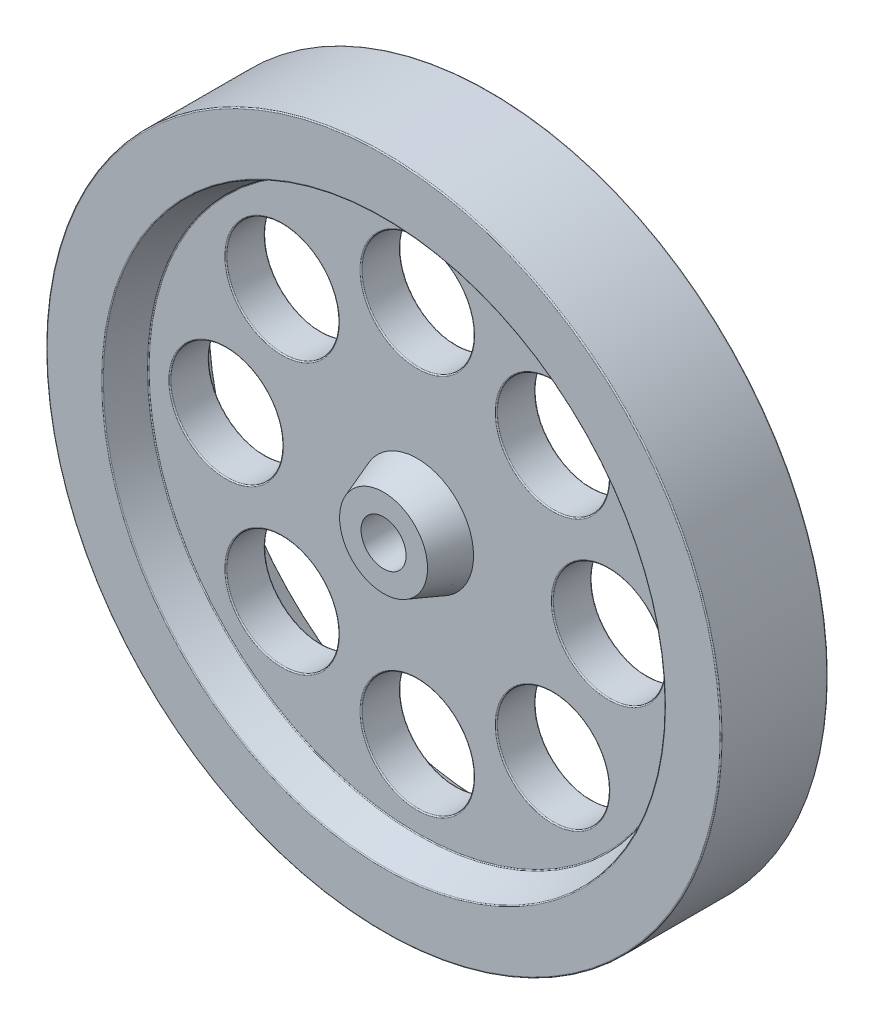
ISO-10303-21;
HEADER;
FILE_DESCRIPTION(('STEP AP214'),'2;1');
FILE_NAME('part.step','',(''),(''),'','','');
FILE_SCHEMA(('AUTOMOTIVE_DESIGN { 1 0 10303 214 1 1 1 1 }'));
ENDSEC;
DATA;
#1=APPLICATION_CONTEXT('core data for automotive mechanical design processes');
#2=APPLICATION_PROTOCOL_DEFINITION('international standard','automotive_design',2000,#1);
#3=PRODUCT_CONTEXT('',#1,'mechanical');
#4=PRODUCT('Part','Part','',(#3));
#5=PRODUCT_RELATED_PRODUCT_CATEGORY('part','',(#4));
#6=PRODUCT_DEFINITION_FORMATION('','',#4);
#7=PRODUCT_DEFINITION_CONTEXT('part definition',#1,'design');
#8=PRODUCT_DEFINITION('design','',#6,#7);
#9=PRODUCT_DEFINITION_SHAPE('','',#8);
#10=(LENGTH_UNIT() NAMED_UNIT(*) SI_UNIT(.MILLI.,.METRE.));
#11=(NAMED_UNIT(*) PLANE_ANGLE_UNIT() SI_UNIT($,.RADIAN.));
#12=(NAMED_UNIT(*) SI_UNIT($,.STERADIAN.) SOLID_ANGLE_UNIT());
#13=UNCERTAINTY_MEASURE_WITH_UNIT(LENGTH_MEASURE(1.E-05),#10,'distance_accuracy_value','');
#14=(GEOMETRIC_REPRESENTATION_CONTEXT(3) GLOBAL_UNCERTAINTY_ASSIGNED_CONTEXT((#13)) GLOBAL_UNIT_ASSIGNED_CONTEXT((#10,
#11,#12)) REPRESENTATION_CONTEXT('',''));
#15=CARTESIAN_POINT('',(0.,0.,0.));
#16=DIRECTION('',(0.,0.,1.));
#17=DIRECTION('',(1.,0.,0.));
#18=AXIS2_PLACEMENT_3D('',#15,#16,#17);
#19=CARTESIAN_POINT('',(0.,0.,4.75));
#20=DIRECTION('',(0.,0.,-1.));
#21=DIRECTION('',(-1.,0.,0.));
#22=AXIS2_PLACEMENT_3D('',#19,#20,#21);
#23=CYLINDRICAL_SURFACE('',#22,30.);
#24=CARTESIAN_POINT('',(0.,0.,-4.65));
#25=DIRECTION('',(0.,0.,1.));
#26=DIRECTION('',(1.,0.,0.));
#27=AXIS2_PLACEMENT_3D('',#24,#25,#26);
#28=CIRCLE('',#27,30.);
#29=CARTESIAN_POINT('',(30.,0.,-4.65));
#30=VERTEX_POINT('',#29);
#31=EDGE_CURVE('E71',#30,#30,#28,.T.);
#32=ORIENTED_EDGE('',*,*,#31,.T.);
#33=EDGE_LOOP('',(#32));
#34=FACE_BOUND('',#33,.T.);
#35=CARTESIAN_POINT('',(0.,0.,4.65));
#36=DIRECTION('',(0.,0.,1.));
#37=DIRECTION('',(1.,0.,0.));
#38=AXIS2_PLACEMENT_3D('',#35,#36,#37);
#39=CIRCLE('',#38,30.);
#40=CARTESIAN_POINT('',(30.,0.,4.65));
#41=VERTEX_POINT('',#40);
#42=EDGE_CURVE('E75',#41,#41,#39,.F.);
#43=ORIENTED_EDGE('',*,*,#42,.T.);
#44=EDGE_LOOP('',(#43));
#45=FACE_BOUND('',#44,.T.);
#46=ADVANCED_FACE('F45',(#34,#45),#23,.T.);
#47=CARTESIAN_POINT('',(0.,0.,4.75));
#48=DIRECTION('',(0.,0.,1.));
#49=DIRECTION('',(1.,0.,0.));
#50=AXIS2_PLACEMENT_3D('',#47,#48,#49);
#51=PLANE('',#50);
#52=CARTESIAN_POINT('',(0.,0.,4.75));
#53=DIRECTION('',(0.,0.,1.));
#54=DIRECTION('',(1.,0.,0.));
#55=AXIS2_PLACEMENT_3D('',#52,#53,#54);
#56=CIRCLE('',#55,25.070020753821);
#57=CARTESIAN_POINT('',(25.070020753821,0.,4.75));
#58=VERTEX_POINT('',#57);
#59=EDGE_CURVE('E10',#58,#58,#56,.F.);
#60=ORIENTED_EDGE('',*,*,#59,.T.);
#61=EDGE_LOOP('',(#60));
#62=FACE_BOUND('',#61,.T.);
#63=CARTESIAN_POINT('',(0.,0.,4.75));
#64=DIRECTION('',(0.,0.,1.));
#65=DIRECTION('',(1.,0.,0.));
#66=AXIS2_PLACEMENT_3D('',#63,#64,#65);
#67=CIRCLE('',#66,29.9);
#68=CARTESIAN_POINT('',(29.9,0.,4.75));
#69=VERTEX_POINT('',#68);
#70=EDGE_CURVE('E53',#69,#69,#67,.T.);
#71=ORIENTED_EDGE('',*,*,#70,.T.);
#72=EDGE_LOOP('',(#71));
#73=FACE_BOUND('',#72,.T.);
#74=ADVANCED_FACE('F332',(#62,#73),#51,.T.);
#75=CARTESIAN_POINT('',(0.,0.,-4.75));
#76=DIRECTION('',(0.,0.,1.));
#77=DIRECTION('',(1.,0.,0.));
#78=AXIS2_PLACEMENT_3D('',#75,#76,#77);
#79=PLANE('',#78);
#80=CARTESIAN_POINT('',(0.,0.,-4.75));
#81=DIRECTION('',(0.,0.,1.));
#82=DIRECTION('',(1.,0.,0.));
#83=AXIS2_PLACEMENT_3D('',#80,#81,#82);
#84=CIRCLE('',#83,25.070020753821);
#85=CARTESIAN_POINT('',(25.070020753821,0.,-4.75));
#86=VERTEX_POINT('',#85);
#87=EDGE_CURVE('E79',#86,#86,#84,.T.);
#88=ORIENTED_EDGE('',*,*,#87,.T.);
#89=EDGE_LOOP('',(#88));
#90=FACE_BOUND('',#89,.T.);
#91=CARTESIAN_POINT('',(0.,0.,-4.75));
#92=DIRECTION('',(0.,0.,1.));
#93=DIRECTION('',(1.,0.,0.));
#94=AXIS2_PLACEMENT_3D('',#91,#92,#93);
#95=CIRCLE('',#94,29.9);
#96=CARTESIAN_POINT('',(29.9,0.,-4.75));
#97=VERTEX_POINT('',#96);
#98=EDGE_CURVE('E83',#97,#97,#95,.F.);
#99=ORIENTED_EDGE('',*,*,#98,.T.);
#100=EDGE_LOOP('',(#99));
#101=FACE_BOUND('',#100,.T.);
#102=ADVANCED_FACE('F328',(#90,#101),#79,.F.);
#103=CARTESIAN_POINT('',(0.,0.,4.75));
#104=DIRECTION('',(0.,0.,1.));
#105=DIRECTION('',(1.,0.,0.));
#106=AXIS2_PLACEMENT_3D('',#103,#104,#105);
#107=CONICAL_SURFACE('',#106,25.,0.349065850398867);
#108=CARTESIAN_POINT('',(0.,0.,1.81579798566743));
#109=DIRECTION('',(0.,0.,-1.));
#110=DIRECTION('',(-1.,0.,0.));
#111=AXIS2_PLACEMENT_3D('',#108,#109,#110);
#112=CIRCLE('',#111,23.932037805459);
#113=CARTESIAN_POINT('',(-23.932037805459,0.,1.81579798566743));
#114=VERTEX_POINT('',#113);
#115=EDGE_CURVE('E59',#114,#114,#112,.T.);
#116=ORIENTED_EDGE('',*,*,#115,.T.);
#117=EDGE_LOOP('',(#116));
#118=FACE_BOUND('',#117,.T.);
#119=CARTESIAN_POINT('',(0.,0.,4.68420201433256));
#120=DIRECTION('',(0.,0.,1.));
#121=DIRECTION('',(1.,0.,0.));
#122=AXIS2_PLACEMENT_3D('',#119,#120,#121);
#123=CIRCLE('',#122,24.9760514917424);
#124=CARTESIAN_POINT('',(24.9760514917424,0.,4.68420201433256));
#125=VERTEX_POINT('',#124);
#126=EDGE_CURVE('E65',#125,#125,#123,.T.);
#127=ORIENTED_EDGE('',*,*,#126,.T.);
#128=EDGE_LOOP('',(#127));
#129=FACE_BOUND('',#128,.T.);
#130=ADVANCED_FACE('F331',(#118,#129),#107,.F.);
#131=CARTESIAN_POINT('',(0.,0.,1.75));
#132=DIRECTION('',(0.,0.,1.));
#133=DIRECTION('',(1.,0.,0.));
#134=AXIS2_PLACEMENT_3D('',#131,#132,#133);
#135=PLANE('',#134);
#136=CARTESIAN_POINT('',(0.,0.,1.75));
#137=DIRECTION('',(0.,0.,1.));
#138=DIRECTION('',(1.,0.,0.));
#139=AXIS2_PLACEMENT_3D('',#136,#137,#138);
#140=CIRCLE('',#139,5.);
#141=CARTESIAN_POINT('',(5.,0.,1.75));
#142=VERTEX_POINT('',#141);
#143=EDGE_CURVE('E235',#142,#142,#140,.T.);
#144=ORIENTED_EDGE('',*,*,#143,.F.);
#145=EDGE_LOOP('',(#144));
#146=FACE_BOUND('',#145,.T.);
#147=CARTESIAN_POINT('',(17.,0.,1.75));
#148=DIRECTION('',(0.,0.,1.));
#149=DIRECTION('',(1.,0.,0.));
#150=AXIS2_PLACEMENT_3D('',#147,#148,#149);
#151=CIRCLE('',#150,5.1);
#152=CARTESIAN_POINT('',(22.1,0.,1.75));
#153=VERTEX_POINT('',#152);
#154=EDGE_CURVE('E187',#153,#153,#151,.F.);
#155=ORIENTED_EDGE('',*,*,#154,.T.);
#156=EDGE_LOOP('',(#155));
#157=FACE_BOUND('',#156,.T.);
#158=CARTESIAN_POINT('',(12.0208152801712,-12.0208152801714,1.75));
#159=DIRECTION('',(0.,0.,1.));
#160=DIRECTION('',(1.,0.,0.));
#161=AXIS2_PLACEMENT_3D('',#158,#159,#160);
#162=CIRCLE('',#161,5.1);
#163=CARTESIAN_POINT('',(17.1208152801712,-12.0208152801714,1.75));
#164=VERTEX_POINT('',#163);
#165=EDGE_CURVE('E191',#164,#164,#162,.F.);
#166=ORIENTED_EDGE('',*,*,#165,.T.);
#167=EDGE_LOOP('',(#166));
#168=FACE_BOUND('',#167,.T.);
#169=CARTESIAN_POINT('',(-1.18710365520667E-13,-17.,1.75));
#170=DIRECTION('',(0.,0.,1.));
#171=DIRECTION('',(1.,0.,0.));
#172=AXIS2_PLACEMENT_3D('',#169,#170,#171);
#173=CIRCLE('',#172,5.1);
#174=CARTESIAN_POINT('',(5.09999999999988,-17.,1.75));
#175=VERTEX_POINT('',#174);
#176=EDGE_CURVE('E195',#175,#175,#173,.F.);
#177=ORIENTED_EDGE('',*,*,#176,.T.);
#178=EDGE_LOOP('',(#177));
#179=FACE_BOUND('',#178,.T.);
#180=CARTESIAN_POINT('',(-12.0208152801714,-12.0208152801712,1.75));
#181=DIRECTION('',(0.,0.,1.));
#182=DIRECTION('',(1.,0.,0.));
#183=AXIS2_PLACEMENT_3D('',#180,#181,#182);
#184=CIRCLE('',#183,5.1);
#185=CARTESIAN_POINT('',(-6.92081528017141,-12.0208152801712,1.75));
#186=VERTEX_POINT('',#185);
#187=EDGE_CURVE('E199',#186,#186,#184,.F.);
#188=ORIENTED_EDGE('',*,*,#187,.T.);
#189=EDGE_LOOP('',(#188));
#190=FACE_BOUND('',#189,.T.);
#191=CARTESIAN_POINT('',(-17.,1.78065548281E-13,1.75));
#192=DIRECTION('',(0.,0.,1.));
#193=DIRECTION('',(1.,0.,0.));
#194=AXIS2_PLACEMENT_3D('',#191,#192,#193);
#195=CIRCLE('',#194,5.1);
#196=CARTESIAN_POINT('',(-11.9,1.78065548281E-13,1.75));
#197=VERTEX_POINT('',#196);
#198=EDGE_CURVE('E203',#197,#197,#195,.F.);
#199=ORIENTED_EDGE('',*,*,#198,.T.);
#200=EDGE_LOOP('',(#199));
#201=FACE_BOUND('',#200,.T.);
#202=CARTESIAN_POINT('',(-12.0208152801712,12.0208152801715,1.75));
#203=DIRECTION('',(0.,0.,1.));
#204=DIRECTION('',(1.,0.,0.));
#205=AXIS2_PLACEMENT_3D('',#202,#203,#204);
#206=CIRCLE('',#205,5.1);
#207=CARTESIAN_POINT('',(-6.92081528017116,12.0208152801715,1.75));
#208=VERTEX_POINT('',#207);
#209=EDGE_CURVE('E207',#208,#208,#206,.F.);
#210=ORIENTED_EDGE('',*,*,#209,.T.);
#211=EDGE_LOOP('',(#210));
#212=FACE_BOUND('',#211,.T.);
#213=CARTESIAN_POINT('',(0.,17.,1.75));
#214=DIRECTION('',(0.,0.,1.));
#215=DIRECTION('',(1.,0.,0.));
#216=AXIS2_PLACEMENT_3D('',#213,#214,#215);
#217=CIRCLE('',#216,5.1);
#218=CARTESIAN_POINT('',(5.1,17.,1.75));
#219=VERTEX_POINT('',#218);
#220=EDGE_CURVE('E211',#219,#219,#217,.F.);
#221=ORIENTED_EDGE('',*,*,#220,.T.);
#222=EDGE_LOOP('',(#221));
#223=FACE_BOUND('',#222,.T.);
#224=CARTESIAN_POINT('',(12.0208152801713,12.0208152801713,1.75));
#225=DIRECTION('',(0.,0.,1.));
#226=DIRECTION('',(1.,0.,0.));
#227=AXIS2_PLACEMENT_3D('',#224,#225,#226);
#228=CIRCLE('',#227,5.1);
#229=CARTESIAN_POINT('',(17.1208152801713,12.0208152801713,1.75));
#230=VERTEX_POINT('',#229);
#231=EDGE_CURVE('E215',#230,#230,#228,.F.);
#232=ORIENTED_EDGE('',*,*,#231,.T.);
#233=EDGE_LOOP('',(#232));
#234=FACE_BOUND('',#233,.T.);
#235=CARTESIAN_POINT('',(0.,0.,1.75));
#236=DIRECTION('',(0.,0.,1.));
#237=DIRECTION('',(1.,0.,0.));
#238=AXIS2_PLACEMENT_3D('',#235,#236,#237);
#239=CIRCLE('',#238,23.8380685433804);
#240=CARTESIAN_POINT('',(23.8380685433804,0.,1.75));
#241=VERTEX_POINT('',#240);
#242=EDGE_CURVE('E219',#241,#241,#239,.T.);
#243=ORIENTED_EDGE('',*,*,#242,.T.);
#244=EDGE_LOOP('',(#243));
#245=FACE_BOUND('',#244,.T.);
#246=ADVANCED_FACE('F318',(#146,#157,#168,#179,#190,#201,#212,#223,#234,#245),#135,.T.);
#247=CARTESIAN_POINT('',(0.,0.,-4.75));
#248=DIRECTION('',(0.,0.,-1.));
#249=DIRECTION('',(1.,0.,0.));
#250=AXIS2_PLACEMENT_3D('',#247,#248,#249);
#251=CONICAL_SURFACE('',#250,25.,0.349065850398867);
#252=CARTESIAN_POINT('',(0.,0.,-1.81579798566743));
#253=DIRECTION('',(0.,0.,-1.));
#254=DIRECTION('',(-1.,0.,0.));
#255=AXIS2_PLACEMENT_3D('',#252,#253,#254);
#256=CIRCLE('',#255,23.932037805459);
#257=CARTESIAN_POINT('',(-23.932037805459,0.,-1.81579798566743));
#258=VERTEX_POINT('',#257);
#259=EDGE_CURVE('E87',#258,#258,#256,.F.);
#260=ORIENTED_EDGE('',*,*,#259,.T.);
#261=EDGE_LOOP('',(#260));
#262=FACE_BOUND('',#261,.T.);
#263=CARTESIAN_POINT('',(0.,0.,-4.68420201433256));
#264=DIRECTION('',(0.,0.,-1.));
#265=DIRECTION('',(-1.,0.,0.));
#266=AXIS2_PLACEMENT_3D('',#263,#264,#265);
#267=CIRCLE('',#266,24.9760514917424);
#268=CARTESIAN_POINT('',(-24.9760514917424,0.,-4.68420201433256));
#269=VERTEX_POINT('',#268);
#270=EDGE_CURVE('E91',#269,#269,#267,.T.);
#271=ORIENTED_EDGE('',*,*,#270,.T.);
#272=EDGE_LOOP('',(#271));
#273=FACE_BOUND('',#272,.T.);
#274=ADVANCED_FACE('F288',(#262,#273),#251,.F.);
#275=CARTESIAN_POINT('',(0.,0.,-1.75));
#276=DIRECTION('',(0.,0.,-1.));
#277=DIRECTION('',(1.,0.,0.));
#278=AXIS2_PLACEMENT_3D('',#275,#276,#277);
#279=PLANE('',#278);
#280=CARTESIAN_POINT('',(0.,0.,-1.75));
#281=DIRECTION('',(0.,0.,-1.));
#282=DIRECTION('',(-1.,0.,0.));
#283=AXIS2_PLACEMENT_3D('',#280,#281,#282);
#284=CIRCLE('',#283,5.);
#285=CARTESIAN_POINT('',(-5.,0.,-1.75));
#286=VERTEX_POINT('',#285);
#287=EDGE_CURVE('E243',#286,#286,#284,.T.);
#288=ORIENTED_EDGE('',*,*,#287,.F.);
#289=EDGE_LOOP('',(#288));
#290=FACE_BOUND('',#289,.T.);
#291=CARTESIAN_POINT('',(17.,0.,-1.75));
#292=DIRECTION('',(0.,0.,-1.));
#293=DIRECTION('',(-1.,0.,0.));
#294=AXIS2_PLACEMENT_3D('',#291,#292,#293);
#295=CIRCLE('',#294,5.1);
#296=CARTESIAN_POINT('',(11.9,0.,-1.75));
#297=VERTEX_POINT('',#296);
#298=EDGE_CURVE('E151',#297,#297,#295,.F.);
#299=ORIENTED_EDGE('',*,*,#298,.T.);
#300=EDGE_LOOP('',(#299));
#301=FACE_BOUND('',#300,.T.);
#302=CARTESIAN_POINT('',(12.0208152801712,-12.0208152801714,-1.75));
#303=DIRECTION('',(0.,0.,-1.));
#304=DIRECTION('',(-1.,0.,0.));
#305=AXIS2_PLACEMENT_3D('',#302,#303,#304);
#306=CIRCLE('',#305,5.1);
#307=CARTESIAN_POINT('',(6.92081528017125,-12.0208152801714,-1.75));
#308=VERTEX_POINT('',#307);
#309=EDGE_CURVE('E155',#308,#308,#306,.F.);
#310=ORIENTED_EDGE('',*,*,#309,.T.);
#311=EDGE_LOOP('',(#310));
#312=FACE_BOUND('',#311,.T.);
#313=CARTESIAN_POINT('',(-1.18710365520667E-13,-17.,-1.75));
#314=DIRECTION('',(0.,0.,-1.));
#315=DIRECTION('',(-1.,0.,0.));
#316=AXIS2_PLACEMENT_3D('',#313,#314,#315);
#317=CIRCLE('',#316,5.1);
#318=CARTESIAN_POINT('',(-5.10000000000012,-17.,-1.75));
#319=VERTEX_POINT('',#318);
#320=EDGE_CURVE('E159',#319,#319,#317,.F.);
#321=ORIENTED_EDGE('',*,*,#320,.T.);
#322=EDGE_LOOP('',(#321));
#323=FACE_BOUND('',#322,.T.);
#324=CARTESIAN_POINT('',(-12.0208152801714,-12.0208152801712,-1.75));
#325=DIRECTION('',(0.,0.,-1.));
#326=DIRECTION('',(-1.,0.,0.));
#327=AXIS2_PLACEMENT_3D('',#324,#325,#326);
#328=CIRCLE('',#327,5.1);
#329=CARTESIAN_POINT('',(-17.1208152801714,-12.0208152801712,-1.75));
#330=VERTEX_POINT('',#329);
#331=EDGE_CURVE('E163',#330,#330,#328,.F.);
#332=ORIENTED_EDGE('',*,*,#331,.T.);
#333=EDGE_LOOP('',(#332));
#334=FACE_BOUND('',#333,.T.);
#335=CARTESIAN_POINT('',(-17.,1.78065548281E-13,-1.75));
#336=DIRECTION('',(0.,0.,-1.));
#337=DIRECTION('',(-1.,0.,0.));
#338=AXIS2_PLACEMENT_3D('',#335,#336,#337);
#339=CIRCLE('',#338,5.1);
#340=CARTESIAN_POINT('',(-22.1,1.78065548281E-13,-1.75));
#341=VERTEX_POINT('',#340);
#342=EDGE_CURVE('E167',#341,#341,#339,.F.);
#343=ORIENTED_EDGE('',*,*,#342,.T.);
#344=EDGE_LOOP('',(#343));
#345=FACE_BOUND('',#344,.T.);
#346=CARTESIAN_POINT('',(-12.0208152801712,12.0208152801715,-1.75));
#347=DIRECTION('',(0.,0.,-1.));
#348=DIRECTION('',(-1.,0.,0.));
#349=AXIS2_PLACEMENT_3D('',#346,#347,#348);
#350=CIRCLE('',#349,5.1);
#351=CARTESIAN_POINT('',(-17.1208152801712,12.0208152801715,-1.75));
#352=VERTEX_POINT('',#351);
#353=EDGE_CURVE('E171',#352,#352,#350,.F.);
#354=ORIENTED_EDGE('',*,*,#353,.T.);
#355=EDGE_LOOP('',(#354));
#356=FACE_BOUND('',#355,.T.);
#357=CARTESIAN_POINT('',(0.,17.,-1.75));
#358=DIRECTION('',(0.,0.,-1.));
#359=DIRECTION('',(-1.,0.,0.));
#360=AXIS2_PLACEMENT_3D('',#357,#358,#359);
#361=CIRCLE('',#360,5.1);
#362=CARTESIAN_POINT('',(-5.1,17.,-1.75));
#363=VERTEX_POINT('',#362);
#364=EDGE_CURVE('E175',#363,#363,#361,.F.);
#365=ORIENTED_EDGE('',*,*,#364,.T.);
#366=EDGE_LOOP('',(#365));
#367=FACE_BOUND('',#366,.T.);
#368=CARTESIAN_POINT('',(12.0208152801713,12.0208152801713,-1.75));
#369=DIRECTION('',(0.,0.,-1.));
#370=DIRECTION('',(-1.,0.,0.));
#371=AXIS2_PLACEMENT_3D('',#368,#369,#370);
#372=CIRCLE('',#371,5.1);
#373=CARTESIAN_POINT('',(6.92081528017133,12.0208152801713,-1.75));
#374=VERTEX_POINT('',#373);
#375=EDGE_CURVE('E179',#374,#374,#372,.F.);
#376=ORIENTED_EDGE('',*,*,#375,.T.);
#377=EDGE_LOOP('',(#376));
#378=FACE_BOUND('',#377,.T.);
#379=CARTESIAN_POINT('',(0.,0.,-1.75));
#380=DIRECTION('',(0.,0.,-1.));
#381=DIRECTION('',(-1.,0.,0.));
#382=AXIS2_PLACEMENT_3D('',#379,#380,#381);
#383=CIRCLE('',#382,23.8380685433804);
#384=CARTESIAN_POINT('',(-23.8380685433804,0.,-1.75));
#385=VERTEX_POINT('',#384);
#386=EDGE_CURVE('E183',#385,#385,#383,.T.);
#387=ORIENTED_EDGE('',*,*,#386,.T.);
#388=EDGE_LOOP('',(#387));
#389=FACE_BOUND('',#388,.T.);
#390=ADVANCED_FACE('F284',(#290,#301,#312,#323,#334,#345,#356,#367,#378,#389),#279,.T.);
#391=CARTESIAN_POINT('',(0.,17.,-4.751));
#392=DIRECTION('',(0.,0.,1.));
#393=DIRECTION('',(1.,0.,0.));
#394=AXIS2_PLACEMENT_3D('',#391,#392,#393);
#395=CYLINDRICAL_SURFACE('',#394,5.);
#396=CARTESIAN_POINT('',(0.,17.,1.65));
#397=DIRECTION('',(0.,0.,1.));
#398=DIRECTION('',(1.,0.,0.));
#399=AXIS2_PLACEMENT_3D('',#396,#397,#398);
#400=CIRCLE('',#399,5.);
#401=CARTESIAN_POINT('',(5.,17.,1.65));
#402=VERTEX_POINT('',#401);
#403=EDGE_CURVE('E103',#402,#402,#400,.T.);
#404=ORIENTED_EDGE('',*,*,#403,.T.);
#405=EDGE_LOOP('',(#404));
#406=FACE_BOUND('',#405,.T.);
#407=CARTESIAN_POINT('',(0.,17.,-1.65));
#408=DIRECTION('',(0.,0.,-1.));
#409=DIRECTION('',(-1.,0.,0.));
#410=AXIS2_PLACEMENT_3D('',#407,#408,#409);
#411=CIRCLE('',#410,5.);
#412=CARTESIAN_POINT('',(-5.,17.,-1.65));
#413=VERTEX_POINT('',#412);
#414=EDGE_CURVE('E107',#413,#413,#411,.T.);
#415=ORIENTED_EDGE('',*,*,#414,.T.);
#416=EDGE_LOOP('',(#415));
#417=FACE_BOUND('',#416,.T.);
#418=ADVANCED_FACE('F287',(#406,#417),#395,.F.);
#419=CARTESIAN_POINT('',(12.0208152801713,12.0208152801713,-4.751));
#420=DIRECTION('',(0.,0.,1.));
#421=DIRECTION('',(1.,0.,0.));
#422=AXIS2_PLACEMENT_3D('',#419,#420,#421);
#423=CYLINDRICAL_SURFACE('',#422,5.);
#424=CARTESIAN_POINT('',(12.0208152801713,12.0208152801713,1.65));
#425=DIRECTION('',(0.,0.,1.));
#426=DIRECTION('',(1.,0.,0.));
#427=AXIS2_PLACEMENT_3D('',#424,#425,#426);
#428=CIRCLE('',#427,5.);
#429=CARTESIAN_POINT('',(17.0208152801713,12.0208152801713,1.65));
#430=VERTEX_POINT('',#429);
#431=EDGE_CURVE('E95',#430,#430,#428,.T.);
#432=ORIENTED_EDGE('',*,*,#431,.T.);
#433=EDGE_LOOP('',(#432));
#434=FACE_BOUND('',#433,.T.);
#435=CARTESIAN_POINT('',(12.0208152801713,12.0208152801713,-1.65));
#436=DIRECTION('',(0.,0.,-1.));
#437=DIRECTION('',(-1.,0.,0.));
#438=AXIS2_PLACEMENT_3D('',#435,#436,#437);
#439=CIRCLE('',#438,5.);
#440=CARTESIAN_POINT('',(7.02081528017133,12.0208152801713,-1.65));
#441=VERTEX_POINT('',#440);
#442=EDGE_CURVE('E99',#441,#441,#439,.T.);
#443=ORIENTED_EDGE('',*,*,#442,.T.);
#444=EDGE_LOOP('',(#443));
#445=FACE_BOUND('',#444,.T.);
#446=ADVANCED_FACE('F439',(#434,#445),#423,.F.);
#447=CARTESIAN_POINT('',(17.,0.,-4.751));
#448=DIRECTION('',(0.,0.,1.));
#449=DIRECTION('',(1.,0.,0.));
#450=AXIS2_PLACEMENT_3D('',#447,#448,#449);
#451=CYLINDRICAL_SURFACE('',#450,5.);
#452=CARTESIAN_POINT('',(17.,0.,1.65));
#453=DIRECTION('',(0.,0.,1.));
#454=DIRECTION('',(1.,0.,0.));
#455=AXIS2_PLACEMENT_3D('',#452,#453,#454);
#456=CIRCLE('',#455,5.);
#457=CARTESIAN_POINT('',(22.,0.,1.65));
#458=VERTEX_POINT('',#457);
#459=EDGE_CURVE('E223',#458,#458,#456,.T.);
#460=ORIENTED_EDGE('',*,*,#459,.T.);
#461=EDGE_LOOP('',(#460));
#462=FACE_BOUND('',#461,.T.);
#463=CARTESIAN_POINT('',(17.,0.,-1.65));
#464=DIRECTION('',(0.,0.,-1.));
#465=DIRECTION('',(-1.,0.,0.));
#466=AXIS2_PLACEMENT_3D('',#463,#464,#465);
#467=CIRCLE('',#466,5.);
#468=CARTESIAN_POINT('',(12.,0.,-1.65));
#469=VERTEX_POINT('',#468);
#470=EDGE_CURVE('E227',#469,#469,#467,.T.);
#471=ORIENTED_EDGE('',*,*,#470,.T.);
#472=EDGE_LOOP('',(#471));
#473=FACE_BOUND('',#472,.T.);
#474=ADVANCED_FACE('F459',(#462,#473),#451,.F.);
#475=CARTESIAN_POINT('',(12.0208152801712,-12.0208152801714,-4.751));
#476=DIRECTION('',(0.,0.,1.));
#477=DIRECTION('',(1.,0.,0.));
#478=AXIS2_PLACEMENT_3D('',#475,#476,#477);
#479=CYLINDRICAL_SURFACE('',#478,5.);
#480=CARTESIAN_POINT('',(12.0208152801712,-12.0208152801714,1.65));
#481=DIRECTION('',(0.,0.,1.));
#482=DIRECTION('',(1.,0.,0.));
#483=AXIS2_PLACEMENT_3D('',#480,#481,#482);
#484=CIRCLE('',#483,5.);
#485=CARTESIAN_POINT('',(17.0208152801712,-12.0208152801714,1.65));
#486=VERTEX_POINT('',#485);
#487=EDGE_CURVE('E143',#486,#486,#484,.T.);
#488=ORIENTED_EDGE('',*,*,#487,.T.);
#489=EDGE_LOOP('',(#488));
#490=FACE_BOUND('',#489,.T.);
#491=CARTESIAN_POINT('',(12.0208152801712,-12.0208152801714,-1.65));
#492=DIRECTION('',(0.,0.,-1.));
#493=DIRECTION('',(-1.,0.,0.));
#494=AXIS2_PLACEMENT_3D('',#491,#492,#493);
#495=CIRCLE('',#494,5.);
#496=CARTESIAN_POINT('',(7.02081528017125,-12.0208152801714,-1.65));
#497=VERTEX_POINT('',#496);
#498=EDGE_CURVE('E147',#497,#497,#495,.T.);
#499=ORIENTED_EDGE('',*,*,#498,.T.);
#500=EDGE_LOOP('',(#499));
#501=FACE_BOUND('',#500,.T.);
#502=ADVANCED_FACE('F455',(#490,#501),#479,.F.);
#503=CARTESIAN_POINT('',(-1.18710365520667E-13,-17.,-4.751));
#504=DIRECTION('',(0.,0.,1.));
#505=DIRECTION('',(1.,0.,0.));
#506=AXIS2_PLACEMENT_3D('',#503,#504,#505);
#507=CYLINDRICAL_SURFACE('',#506,5.);
#508=CARTESIAN_POINT('',(-1.18710365520667E-13,-17.,1.65));
#509=DIRECTION('',(0.,0.,1.));
#510=DIRECTION('',(1.,0.,0.));
#511=AXIS2_PLACEMENT_3D('',#508,#509,#510);
#512=CIRCLE('',#511,5.);
#513=CARTESIAN_POINT('',(4.99999999999988,-17.,1.65));
#514=VERTEX_POINT('',#513);
#515=EDGE_CURVE('E135',#514,#514,#512,.T.);
#516=ORIENTED_EDGE('',*,*,#515,.T.);
#517=EDGE_LOOP('',(#516));
#518=FACE_BOUND('',#517,.T.);
#519=CARTESIAN_POINT('',(-1.18710365520667E-13,-17.,-1.65));
#520=DIRECTION('',(0.,0.,-1.));
#521=DIRECTION('',(-1.,0.,0.));
#522=AXIS2_PLACEMENT_3D('',#519,#520,#521);
#523=CIRCLE('',#522,5.);
#524=CARTESIAN_POINT('',(-5.00000000000012,-17.,-1.65));
#525=VERTEX_POINT('',#524);
#526=EDGE_CURVE('E139',#525,#525,#523,.T.);
#527=ORIENTED_EDGE('',*,*,#526,.T.);
#528=EDGE_LOOP('',(#527));
#529=FACE_BOUND('',#528,.T.);
#530=ADVANCED_FACE('F451',(#518,#529),#507,.F.);
#531=CARTESIAN_POINT('',(-12.0208152801714,-12.0208152801712,-4.751));
#532=DIRECTION('',(0.,0.,1.));
#533=DIRECTION('',(1.,0.,0.));
#534=AXIS2_PLACEMENT_3D('',#531,#532,#533);
#535=CYLINDRICAL_SURFACE('',#534,5.);
#536=CARTESIAN_POINT('',(-12.0208152801714,-12.0208152801712,1.65));
#537=DIRECTION('',(0.,0.,1.));
#538=DIRECTION('',(1.,0.,0.));
#539=AXIS2_PLACEMENT_3D('',#536,#537,#538);
#540=CIRCLE('',#539,5.);
#541=CARTESIAN_POINT('',(-7.02081528017141,-12.0208152801712,1.65));
#542=VERTEX_POINT('',#541);
#543=EDGE_CURVE('E127',#542,#542,#540,.T.);
#544=ORIENTED_EDGE('',*,*,#543,.T.);
#545=EDGE_LOOP('',(#544));
#546=FACE_BOUND('',#545,.T.);
#547=CARTESIAN_POINT('',(-12.0208152801714,-12.0208152801712,-1.65));
#548=DIRECTION('',(0.,0.,-1.));
#549=DIRECTION('',(-1.,0.,0.));
#550=AXIS2_PLACEMENT_3D('',#547,#548,#549);
#551=CIRCLE('',#550,5.);
#552=CARTESIAN_POINT('',(-17.0208152801714,-12.0208152801712,-1.65));
#553=VERTEX_POINT('',#552);
#554=EDGE_CURVE('E131',#553,#553,#551,.T.);
#555=ORIENTED_EDGE('',*,*,#554,.T.);
#556=EDGE_LOOP('',(#555));
#557=FACE_BOUND('',#556,.T.);
#558=ADVANCED_FACE('F447',(#546,#557),#535,.F.);
#559=CARTESIAN_POINT('',(-17.,1.78065548281E-13,-4.751));
#560=DIRECTION('',(0.,0.,1.));
#561=DIRECTION('',(1.,0.,0.));
#562=AXIS2_PLACEMENT_3D('',#559,#560,#561);
#563=CYLINDRICAL_SURFACE('',#562,5.);
#564=CARTESIAN_POINT('',(-17.,1.78065548281E-13,1.65));
#565=DIRECTION('',(0.,0.,1.));
#566=DIRECTION('',(1.,0.,0.));
#567=AXIS2_PLACEMENT_3D('',#564,#565,#566);
#568=CIRCLE('',#567,5.);
#569=CARTESIAN_POINT('',(-12.,1.78065548281E-13,1.65));
#570=VERTEX_POINT('',#569);
#571=EDGE_CURVE('E119',#570,#570,#568,.T.);
#572=ORIENTED_EDGE('',*,*,#571,.T.);
#573=EDGE_LOOP('',(#572));
#574=FACE_BOUND('',#573,.T.);
#575=CARTESIAN_POINT('',(-17.,1.78065548281E-13,-1.65));
#576=DIRECTION('',(0.,0.,-1.));
#577=DIRECTION('',(-1.,0.,0.));
#578=AXIS2_PLACEMENT_3D('',#575,#576,#577);
#579=CIRCLE('',#578,5.);
#580=CARTESIAN_POINT('',(-22.,1.78065548281E-13,-1.65));
#581=VERTEX_POINT('',#580);
#582=EDGE_CURVE('E123',#581,#581,#579,.T.);
#583=ORIENTED_EDGE('',*,*,#582,.T.);
#584=EDGE_LOOP('',(#583));
#585=FACE_BOUND('',#584,.T.);
#586=ADVANCED_FACE('F443',(#574,#585),#563,.F.);
#587=CARTESIAN_POINT('',(-12.0208152801712,12.0208152801715,-4.751));
#588=DIRECTION('',(0.,0.,1.));
#589=DIRECTION('',(1.,0.,0.));
#590=AXIS2_PLACEMENT_3D('',#587,#588,#589);
#591=CYLINDRICAL_SURFACE('',#590,5.);
#592=CARTESIAN_POINT('',(-12.0208152801712,12.0208152801715,1.65));
#593=DIRECTION('',(0.,0.,1.));
#594=DIRECTION('',(1.,0.,0.));
#595=AXIS2_PLACEMENT_3D('',#592,#593,#594);
#596=CIRCLE('',#595,5.);
#597=CARTESIAN_POINT('',(-7.02081528017116,12.0208152801715,1.65));
#598=VERTEX_POINT('',#597);
#599=EDGE_CURVE('E111',#598,#598,#596,.T.);
#600=ORIENTED_EDGE('',*,*,#599,.T.);
#601=EDGE_LOOP('',(#600));
#602=FACE_BOUND('',#601,.T.);
#603=CARTESIAN_POINT('',(-12.0208152801712,12.0208152801715,-1.65));
#604=DIRECTION('',(0.,0.,-1.));
#605=DIRECTION('',(-1.,0.,0.));
#606=AXIS2_PLACEMENT_3D('',#603,#604,#605);
#607=CIRCLE('',#606,5.);
#608=CARTESIAN_POINT('',(-17.0208152801712,12.0208152801715,-1.65));
#609=VERTEX_POINT('',#608);
#610=EDGE_CURVE('E115',#609,#609,#607,.T.);
#611=ORIENTED_EDGE('',*,*,#610,.T.);
#612=EDGE_LOOP('',(#611));
#613=FACE_BOUND('',#612,.T.);
#614=ADVANCED_FACE('F426',(#602,#613),#591,.F.);
#615=CARTESIAN_POINT('',(17.,0.,1.65));
#616=DIRECTION('',(0.,0.,1.));
#617=DIRECTION('',(1.,0.,0.));
#618=AXIS2_PLACEMENT_3D('',#615,#616,#617);
#619=TOROIDAL_SURFACE('',#618,5.1,0.1);
#620=ORIENTED_EDGE('',*,*,#154,.F.);
#621=EDGE_LOOP('',(#620));
#622=FACE_BOUND('',#621,.T.);
#623=ORIENTED_EDGE('',*,*,#459,.F.);
#624=EDGE_LOOP('',(#623));
#625=FACE_BOUND('',#624,.T.);
#626=ADVANCED_FACE('F423',(#622,#625),#619,.T.);
#627=CARTESIAN_POINT('',(17.,0.,-1.65));
#628=DIRECTION('',(0.,0.,-1.));
#629=DIRECTION('',(-1.,0.,0.));
#630=AXIS2_PLACEMENT_3D('',#627,#628,#629);
#631=TOROIDAL_SURFACE('',#630,5.1,0.1);
#632=ORIENTED_EDGE('',*,*,#470,.F.);
#633=EDGE_LOOP('',(#632));
#634=FACE_BOUND('',#633,.T.);
#635=ORIENTED_EDGE('',*,*,#298,.F.);
#636=EDGE_LOOP('',(#635));
#637=FACE_BOUND('',#636,.T.);
#638=ADVANCED_FACE('F419',(#634,#637),#631,.T.);
#639=CARTESIAN_POINT('',(12.0208152801712,-12.0208152801714,1.65));
#640=DIRECTION('',(0.,0.,1.));
#641=DIRECTION('',(1.,0.,0.));
#642=AXIS2_PLACEMENT_3D('',#639,#640,#641);
#643=TOROIDAL_SURFACE('',#642,5.1,0.1);
#644=ORIENTED_EDGE('',*,*,#165,.F.);
#645=EDGE_LOOP('',(#644));
#646=FACE_BOUND('',#645,.T.);
#647=ORIENTED_EDGE('',*,*,#487,.F.);
#648=EDGE_LOOP('',(#647));
#649=FACE_BOUND('',#648,.T.);
#650=ADVANCED_FACE('F415',(#646,#649),#643,.T.);
#651=CARTESIAN_POINT('',(12.0208152801712,-12.0208152801714,-1.65));
#652=DIRECTION('',(0.,0.,-1.));
#653=DIRECTION('',(-1.,0.,0.));
#654=AXIS2_PLACEMENT_3D('',#651,#652,#653);
#655=TOROIDAL_SURFACE('',#654,5.1,0.1);
#656=ORIENTED_EDGE('',*,*,#498,.F.);
#657=EDGE_LOOP('',(#656));
#658=FACE_BOUND('',#657,.T.);
#659=ORIENTED_EDGE('',*,*,#309,.F.);
#660=EDGE_LOOP('',(#659));
#661=FACE_BOUND('',#660,.T.);
#662=ADVANCED_FACE('F411',(#658,#661),#655,.T.);
#663=CARTESIAN_POINT('',(-1.18710365520667E-13,-17.,1.65));
#664=DIRECTION('',(0.,0.,1.));
#665=DIRECTION('',(1.,0.,0.));
#666=AXIS2_PLACEMENT_3D('',#663,#664,#665);
#667=TOROIDAL_SURFACE('',#666,5.1,0.1);
#668=ORIENTED_EDGE('',*,*,#176,.F.);
#669=EDGE_LOOP('',(#668));
#670=FACE_BOUND('',#669,.T.);
#671=ORIENTED_EDGE('',*,*,#515,.F.);
#672=EDGE_LOOP('',(#671));
#673=FACE_BOUND('',#672,.T.);
#674=ADVANCED_FACE('F407',(#670,#673),#667,.T.);
#675=CARTESIAN_POINT('',(-1.18710365520667E-13,-17.,-1.65));
#676=DIRECTION('',(0.,0.,-1.));
#677=DIRECTION('',(-1.,0.,0.));
#678=AXIS2_PLACEMENT_3D('',#675,#676,#677);
#679=TOROIDAL_SURFACE('',#678,5.1,0.1);
#680=ORIENTED_EDGE('',*,*,#526,.F.);
#681=EDGE_LOOP('',(#680));
#682=FACE_BOUND('',#681,.T.);
#683=ORIENTED_EDGE('',*,*,#320,.F.);
#684=EDGE_LOOP('',(#683));
#685=FACE_BOUND('',#684,.T.);
#686=ADVANCED_FACE('F403',(#682,#685),#679,.T.);
#687=CARTESIAN_POINT('',(-12.0208152801714,-12.0208152801712,1.65));
#688=DIRECTION('',(0.,0.,1.));
#689=DIRECTION('',(1.,0.,0.));
#690=AXIS2_PLACEMENT_3D('',#687,#688,#689);
#691=TOROIDAL_SURFACE('',#690,5.1,0.1);
#692=ORIENTED_EDGE('',*,*,#187,.F.);
#693=EDGE_LOOP('',(#692));
#694=FACE_BOUND('',#693,.T.);
#695=ORIENTED_EDGE('',*,*,#543,.F.);
#696=EDGE_LOOP('',(#695));
#697=FACE_BOUND('',#696,.T.);
#698=ADVANCED_FACE('F399',(#694,#697),#691,.T.);
#699=CARTESIAN_POINT('',(-12.0208152801714,-12.0208152801712,-1.65));
#700=DIRECTION('',(0.,0.,-1.));
#701=DIRECTION('',(-1.,0.,0.));
#702=AXIS2_PLACEMENT_3D('',#699,#700,#701);
#703=TOROIDAL_SURFACE('',#702,5.1,0.1);
#704=ORIENTED_EDGE('',*,*,#554,.F.);
#705=EDGE_LOOP('',(#704));
#706=FACE_BOUND('',#705,.T.);
#707=ORIENTED_EDGE('',*,*,#331,.F.);
#708=EDGE_LOOP('',(#707));
#709=FACE_BOUND('',#708,.T.);
#710=ADVANCED_FACE('F395',(#706,#709),#703,.T.);
#711=CARTESIAN_POINT('',(-17.,1.78065548281E-13,1.65));
#712=DIRECTION('',(0.,0.,1.));
#713=DIRECTION('',(1.,0.,0.));
#714=AXIS2_PLACEMENT_3D('',#711,#712,#713);
#715=TOROIDAL_SURFACE('',#714,5.1,0.1);
#716=ORIENTED_EDGE('',*,*,#198,.F.);
#717=EDGE_LOOP('',(#716));
#718=FACE_BOUND('',#717,.T.);
#719=ORIENTED_EDGE('',*,*,#571,.F.);
#720=EDGE_LOOP('',(#719));
#721=FACE_BOUND('',#720,.T.);
#722=ADVANCED_FACE('F391',(#718,#721),#715,.T.);
#723=CARTESIAN_POINT('',(-17.,1.78065548281E-13,-1.65));
#724=DIRECTION('',(0.,0.,-1.));
#725=DIRECTION('',(-1.,0.,0.));
#726=AXIS2_PLACEMENT_3D('',#723,#724,#725);
#727=TOROIDAL_SURFACE('',#726,5.1,0.1);
#728=ORIENTED_EDGE('',*,*,#582,.F.);
#729=EDGE_LOOP('',(#728));
#730=FACE_BOUND('',#729,.T.);
#731=ORIENTED_EDGE('',*,*,#342,.F.);
#732=EDGE_LOOP('',(#731));
#733=FACE_BOUND('',#732,.T.);
#734=ADVANCED_FACE('F387',(#730,#733),#727,.T.);
#735=CARTESIAN_POINT('',(-12.0208152801712,12.0208152801715,1.65));
#736=DIRECTION('',(0.,0.,1.));
#737=DIRECTION('',(1.,0.,0.));
#738=AXIS2_PLACEMENT_3D('',#735,#736,#737);
#739=TOROIDAL_SURFACE('',#738,5.1,0.1);
#740=ORIENTED_EDGE('',*,*,#209,.F.);
#741=EDGE_LOOP('',(#740));
#742=FACE_BOUND('',#741,.T.);
#743=ORIENTED_EDGE('',*,*,#599,.F.);
#744=EDGE_LOOP('',(#743));
#745=FACE_BOUND('',#744,.T.);
#746=ADVANCED_FACE('F383',(#742,#745),#739,.T.);
#747=CARTESIAN_POINT('',(-12.0208152801712,12.0208152801715,-1.65));
#748=DIRECTION('',(0.,0.,-1.));
#749=DIRECTION('',(-1.,0.,0.));
#750=AXIS2_PLACEMENT_3D('',#747,#748,#749);
#751=TOROIDAL_SURFACE('',#750,5.1,0.1);
#752=ORIENTED_EDGE('',*,*,#610,.F.);
#753=EDGE_LOOP('',(#752));
#754=FACE_BOUND('',#753,.T.);
#755=ORIENTED_EDGE('',*,*,#353,.F.);
#756=EDGE_LOOP('',(#755));
#757=FACE_BOUND('',#756,.T.);
#758=ADVANCED_FACE('F379',(#754,#757),#751,.T.);
#759=CARTESIAN_POINT('',(0.,17.,1.65));
#760=DIRECTION('',(0.,0.,1.));
#761=DIRECTION('',(1.,0.,0.));
#762=AXIS2_PLACEMENT_3D('',#759,#760,#761);
#763=TOROIDAL_SURFACE('',#762,5.1,0.1);
#764=ORIENTED_EDGE('',*,*,#220,.F.);
#765=EDGE_LOOP('',(#764));
#766=FACE_BOUND('',#765,.T.);
#767=ORIENTED_EDGE('',*,*,#403,.F.);
#768=EDGE_LOOP('',(#767));
#769=FACE_BOUND('',#768,.T.);
#770=ADVANCED_FACE('F375',(#766,#769),#763,.T.);
#771=CARTESIAN_POINT('',(0.,17.,-1.65));
#772=DIRECTION('',(0.,0.,-1.));
#773=DIRECTION('',(-1.,0.,0.));
#774=AXIS2_PLACEMENT_3D('',#771,#772,#773);
#775=TOROIDAL_SURFACE('',#774,5.1,0.1);
#776=ORIENTED_EDGE('',*,*,#414,.F.);
#777=EDGE_LOOP('',(#776));
#778=FACE_BOUND('',#777,.T.);
#779=ORIENTED_EDGE('',*,*,#364,.F.);
#780=EDGE_LOOP('',(#779));
#781=FACE_BOUND('',#780,.T.);
#782=ADVANCED_FACE('F371',(#778,#781),#775,.T.);
#783=CARTESIAN_POINT('',(12.0208152801713,12.0208152801713,1.65));
#784=DIRECTION('',(0.,0.,1.));
#785=DIRECTION('',(1.,0.,0.));
#786=AXIS2_PLACEMENT_3D('',#783,#784,#785);
#787=TOROIDAL_SURFACE('',#786,5.1,0.1);
#788=ORIENTED_EDGE('',*,*,#231,.F.);
#789=EDGE_LOOP('',(#788));
#790=FACE_BOUND('',#789,.T.);
#791=ORIENTED_EDGE('',*,*,#431,.F.);
#792=EDGE_LOOP('',(#791));
#793=FACE_BOUND('',#792,.T.);
#794=ADVANCED_FACE('F367',(#790,#793),#787,.T.);
#795=CARTESIAN_POINT('',(12.0208152801713,12.0208152801713,-1.65));
#796=DIRECTION('',(0.,0.,-1.));
#797=DIRECTION('',(-1.,0.,0.));
#798=AXIS2_PLACEMENT_3D('',#795,#796,#797);
#799=TOROIDAL_SURFACE('',#798,5.1,0.1);
#800=ORIENTED_EDGE('',*,*,#442,.F.);
#801=EDGE_LOOP('',(#800));
#802=FACE_BOUND('',#801,.T.);
#803=ORIENTED_EDGE('',*,*,#375,.F.);
#804=EDGE_LOOP('',(#803));
#805=FACE_BOUND('',#804,.T.);
#806=ADVANCED_FACE('F312',(#802,#805),#799,.T.);
#807=CARTESIAN_POINT('',(0.,0.,-1.85));
#808=DIRECTION('',(0.,0.,-1.));
#809=DIRECTION('',(-1.,0.,0.));
#810=AXIS2_PLACEMENT_3D('',#807,#808,#809);
#811=TOROIDAL_SURFACE('',#810,23.8380685433804,0.1);
#812=ORIENTED_EDGE('',*,*,#386,.F.);
#813=EDGE_LOOP('',(#812));
#814=FACE_BOUND('',#813,.T.);
#815=ORIENTED_EDGE('',*,*,#259,.F.);
#816=EDGE_LOOP('',(#815));
#817=FACE_BOUND('',#816,.T.);
#818=ADVANCED_FACE('F308',(#814,#817),#811,.F.);
#819=CARTESIAN_POINT('',(0.,0.,-4.65));
#820=DIRECTION('',(0.,0.,1.));
#821=DIRECTION('',(1.,0.,0.));
#822=AXIS2_PLACEMENT_3D('',#819,#820,#821);
#823=TOROIDAL_SURFACE('',#822,25.070020753821,0.1);
#824=ORIENTED_EDGE('',*,*,#270,.F.);
#825=EDGE_LOOP('',(#824));
#826=FACE_BOUND('',#825,.T.);
#827=ORIENTED_EDGE('',*,*,#87,.F.);
#828=EDGE_LOOP('',(#827));
#829=FACE_BOUND('',#828,.T.);
#830=ADVANCED_FACE('F311',(#826,#829),#823,.T.);
#831=CARTESIAN_POINT('',(0.,0.,-4.65));
#832=DIRECTION('',(0.,0.,1.));
#833=DIRECTION('',(1.,0.,0.));
#834=AXIS2_PLACEMENT_3D('',#831,#832,#833);
#835=TOROIDAL_SURFACE('',#834,29.9,0.1);
#836=ORIENTED_EDGE('',*,*,#98,.F.);
#837=EDGE_LOOP('',(#836));
#838=FACE_BOUND('',#837,.T.);
#839=ORIENTED_EDGE('',*,*,#31,.F.);
#840=EDGE_LOOP('',(#839));
#841=FACE_BOUND('',#840,.T.);
#842=ADVANCED_FACE('F324',(#838,#841),#835,.T.);
#843=CARTESIAN_POINT('',(0.,0.,1.85));
#844=DIRECTION('',(0.,0.,1.));
#845=DIRECTION('',(1.,0.,0.));
#846=AXIS2_PLACEMENT_3D('',#843,#844,#845);
#847=TOROIDAL_SURFACE('',#846,23.8380685433804,0.1);
#848=ORIENTED_EDGE('',*,*,#115,.F.);
#849=EDGE_LOOP('',(#848));
#850=FACE_BOUND('',#849,.T.);
#851=ORIENTED_EDGE('',*,*,#242,.F.);
#852=EDGE_LOOP('',(#851));
#853=FACE_BOUND('',#852,.T.);
#854=ADVANCED_FACE('F338',(#850,#853),#847,.F.);
#855=CARTESIAN_POINT('',(0.,0.,4.65));
#856=DIRECTION('',(0.,0.,1.));
#857=DIRECTION('',(1.,0.,0.));
#858=AXIS2_PLACEMENT_3D('',#855,#856,#857);
#859=TOROIDAL_SURFACE('',#858,25.070020753821,0.1);
#860=ORIENTED_EDGE('',*,*,#59,.F.);
#861=EDGE_LOOP('',(#860));
#862=FACE_BOUND('',#861,.T.);
#863=ORIENTED_EDGE('',*,*,#126,.F.);
#864=EDGE_LOOP('',(#863));
#865=FACE_BOUND('',#864,.T.);
#866=ADVANCED_FACE('F350',(#862,#865),#859,.T.);
#867=CARTESIAN_POINT('',(0.,0.,4.65));
#868=DIRECTION('',(0.,0.,1.));
#869=DIRECTION('',(1.,0.,0.));
#870=AXIS2_PLACEMENT_3D('',#867,#868,#869);
#871=TOROIDAL_SURFACE('',#870,29.9,0.1);
#872=ORIENTED_EDGE('',*,*,#42,.F.);
#873=EDGE_LOOP('',(#872));
#874=FACE_BOUND('',#873,.T.);
#875=ORIENTED_EDGE('',*,*,#70,.F.);
#876=EDGE_LOOP('',(#875));
#877=FACE_BOUND('',#876,.T.);
#878=ADVANCED_FACE('F47',(#874,#877),#871,.T.);
#879=CARTESIAN_POINT('',(0.,0.,1.75));
#880=DIRECTION('',(0.,0.,-1.));
#881=DIRECTION('',(1.,0.,0.));
#882=AXIS2_PLACEMENT_3D('',#879,#880,#881);
#883=CONICAL_SURFACE('',#882,5.,0.349065850398867);
#884=CARTESIAN_POINT('',(0.,0.,4.75));
#885=DIRECTION('',(0.,0.,1.));
#886=DIRECTION('',(1.,0.,0.));
#887=AXIS2_PLACEMENT_3D('',#884,#885,#886);
#888=CIRCLE('',#887,3.90808929720139);
#889=CARTESIAN_POINT('',(3.90808929720139,0.,4.75));
#890=VERTEX_POINT('',#889);
#891=EDGE_CURVE('E231',#890,#890,#888,.T.);
#892=ORIENTED_EDGE('',*,*,#891,.F.);
#893=EDGE_LOOP('',(#892));
#894=FACE_BOUND('',#893,.T.);
#895=ORIENTED_EDGE('',*,*,#143,.T.);
#896=EDGE_LOOP('',(#895));
#897=FACE_BOUND('',#896,.T.);
#898=ADVANCED_FACE('F349',(#894,#897),#883,.T.);
#899=CARTESIAN_POINT('',(0.,0.,4.75));
#900=DIRECTION('',(0.,0.,1.));
#901=DIRECTION('',(1.,0.,0.));
#902=AXIS2_PLACEMENT_3D('',#899,#900,#901);
#903=PLANE('',#902);
#904=CARTESIAN_POINT('',(0.,0.,4.75));
#905=DIRECTION('',(0.,0.,-1.));
#906=DIRECTION('',(-1.,0.,0.));
#907=AXIS2_PLACEMENT_3D('',#904,#905,#906);
#908=CIRCLE('',#907,2.);
#909=CARTESIAN_POINT('',(-2.,0.,4.75));
#910=VERTEX_POINT('',#909);
#911=EDGE_CURVE('E247',#910,#910,#908,.T.);
#912=ORIENTED_EDGE('',*,*,#911,.T.);
#913=EDGE_LOOP('',(#912));
#914=FACE_BOUND('',#913,.T.);
#915=ORIENTED_EDGE('',*,*,#891,.T.);
#916=EDGE_LOOP('',(#915));
#917=FACE_BOUND('',#916,.T.);
#918=ADVANCED_FACE('F280',(#914,#917),#903,.T.);
#919=CARTESIAN_POINT('',(0.,0.,-1.75));
#920=DIRECTION('',(0.,0.,1.));
#921=DIRECTION('',(-1.,0.,0.));
#922=AXIS2_PLACEMENT_3D('',#919,#920,#921);
#923=CONICAL_SURFACE('',#922,5.,0.349065850398867);
#924=CARTESIAN_POINT('',(0.,0.,-4.75));
#925=DIRECTION('',(0.,0.,-1.));
#926=DIRECTION('',(-1.,0.,0.));
#927=AXIS2_PLACEMENT_3D('',#924,#925,#926);
#928=CIRCLE('',#927,3.90808929720139);
#929=CARTESIAN_POINT('',(-3.90808929720139,0.,-4.75));
#930=VERTEX_POINT('',#929);
#931=EDGE_CURVE('E239',#930,#930,#928,.T.);
#932=ORIENTED_EDGE('',*,*,#931,.F.);
#933=EDGE_LOOP('',(#932));
#934=FACE_BOUND('',#933,.T.);
#935=ORIENTED_EDGE('',*,*,#287,.T.);
#936=EDGE_LOOP('',(#935));
#937=FACE_BOUND('',#936,.T.);
#938=ADVANCED_FACE('F274',(#934,#937),#923,.T.);
#939=CARTESIAN_POINT('',(0.,0.,-4.75));
#940=DIRECTION('',(0.,0.,-1.));
#941=DIRECTION('',(-1.,0.,0.));
#942=AXIS2_PLACEMENT_3D('',#939,#940,#941);
#943=PLANE('',#942);
#944=CARTESIAN_POINT('',(0.,0.,-4.75));
#945=DIRECTION('',(0.,0.,-1.));
#946=DIRECTION('',(-1.,0.,0.));
#947=AXIS2_PLACEMENT_3D('',#944,#945,#946);
#948=CIRCLE('',#947,2.49999999999999);
#949=CARTESIAN_POINT('',(-2.49999999999999,0.,-4.75));
#950=VERTEX_POINT('',#949);
#951=EDGE_CURVE('E263',#950,#950,#948,.T.);
#952=ORIENTED_EDGE('',*,*,#951,.F.);
#953=EDGE_LOOP('',(#952));
#954=FACE_BOUND('',#953,.T.);
#955=ORIENTED_EDGE('',*,*,#931,.T.);
#956=EDGE_LOOP('',(#955));
#957=FACE_BOUND('',#956,.T.);
#958=ADVANCED_FACE('F270',(#954,#957),#943,.T.);
#959=CARTESIAN_POINT('',(0.,0.,-4.75));
#960=DIRECTION('',(0.,0.,-1.));
#961=DIRECTION('',(-1.,0.,0.));
#962=AXIS2_PLACEMENT_3D('',#959,#960,#961);
#963=CYLINDRICAL_SURFACE('',#962,2.);
#964=ORIENTED_EDGE('',*,*,#911,.F.);
#965=EDGE_LOOP('',(#964));
#966=FACE_BOUND('',#965,.T.);
#967=CARTESIAN_POINT('',(0.,0.,-1.25));
#968=DIRECTION('',(0.,0.,-1.));
#969=DIRECTION('',(-1.,0.,0.));
#970=AXIS2_PLACEMENT_3D('',#967,#968,#969);
#971=CIRCLE('',#970,2.);
#972=CARTESIAN_POINT('',(-2.,0.,-1.25));
#973=VERTEX_POINT('',#972);
#974=EDGE_CURVE('E251',#973,#973,#971,.T.);
#975=ORIENTED_EDGE('',*,*,#974,.T.);
#976=EDGE_LOOP('',(#975));
#977=FACE_BOUND('',#976,.T.);
#978=ADVANCED_FACE('F273',(#966,#977),#963,.F.);
#979=CARTESIAN_POINT('',(0.,2.,-1.25));
#980=DIRECTION('',(0.,0.,-1.));
#981=DIRECTION('',(-1.,0.,0.));
#982=AXIS2_PLACEMENT_3D('',#979,#980,#981);
#983=PLANE('',#982);
#984=ORIENTED_EDGE('',*,*,#974,.F.);
#985=EDGE_LOOP('',(#984));
#986=FACE_BOUND('',#985,.T.);
#987=CARTESIAN_POINT('',(0.,0.,-1.25));
#988=DIRECTION('',(0.,0.,-1.));
#989=DIRECTION('',(-1.,0.,0.));
#990=AXIS2_PLACEMENT_3D('',#987,#988,#989);
#991=CIRCLE('',#990,1.5);
#992=CARTESIAN_POINT('',(-1.5,0.,-1.25));
#993=VERTEX_POINT('',#992);
#994=EDGE_CURVE('E255',#993,#993,#991,.T.);
#995=ORIENTED_EDGE('',*,*,#994,.T.);
#996=EDGE_LOOP('',(#995));
#997=FACE_BOUND('',#996,.T.);
#998=ADVANCED_FACE('F472',(#986,#997),#983,.F.);
#999=CARTESIAN_POINT('',(0.,0.,-4.75));
#1000=DIRECTION('',(0.,0.,-1.));
#1001=DIRECTION('',(-1.,0.,0.));
#1002=AXIS2_PLACEMENT_3D('',#999,#1000,#1001);
#1003=CYLINDRICAL_SURFACE('',#1002,1.5);
#1004=ORIENTED_EDGE('',*,*,#994,.F.);
#1005=EDGE_LOOP('',(#1004));
#1006=FACE_BOUND('',#1005,.T.);
#1007=CARTESIAN_POINT('',(0.,0.,-3.75));
#1008=DIRECTION('',(0.,0.,-1.));
#1009=DIRECTION('',(-1.,0.,0.));
#1010=AXIS2_PLACEMENT_3D('',#1007,#1008,#1009);
#1011=CIRCLE('',#1010,1.5);
#1012=CARTESIAN_POINT('',(-1.5,0.,-3.75));
#1013=VERTEX_POINT('',#1012);
#1014=EDGE_CURVE('E259',#1013,#1013,#1011,.T.);
#1015=ORIENTED_EDGE('',*,*,#1014,.T.);
#1016=EDGE_LOOP('',(#1015));
#1017=FACE_BOUND('',#1016,.T.);
#1018=ADVANCED_FACE('F476',(#1006,#1017),#1003,.F.);
#1019=CARTESIAN_POINT('',(0.,0.,-4.75));
#1020=DIRECTION('',(0.,0.,-1.));
#1021=DIRECTION('',(-1.,0.,0.));
#1022=AXIS2_PLACEMENT_3D('',#1019,#1020,#1021);
#1023=CONICAL_SURFACE('',#1022,2.49999999999999,0.785398163397443);
#1024=ORIENTED_EDGE('',*,*,#1014,.F.);
#1025=EDGE_LOOP('',(#1024));
#1026=FACE_BOUND('',#1025,.T.);
#1027=ORIENTED_EDGE('',*,*,#951,.T.);
#1028=EDGE_LOOP('',(#1027));
#1029=FACE_BOUND('',#1028,.T.);
#1030=ADVANCED_FACE('F268',(#1026,#1029),#1023,.F.);
#1031=CLOSED_SHELL('',(#46,#74,#102,#130,#246,#274,#390,#418,#446,#474,#502,#530,#558,#586,#614,
#626,#638,#650,#662,#674,#686,#698,#710,#722,#734,#746,#758,#770,#782,#794,#806,#818,#830,#842,
#854,#866,#878,#898,#918,#938,#958,#978,#998,#1018,#1030));
#1032=MANIFOLD_SOLID_BREP('B2',#1031);
#1033=ADVANCED_BREP_SHAPE_REPRESENTATION('',(#18,#1032),#14);
#1034=SHAPE_DEFINITION_REPRESENTATION(#9,#1033);
ENDSEC;
END-ISO-10303-21;
